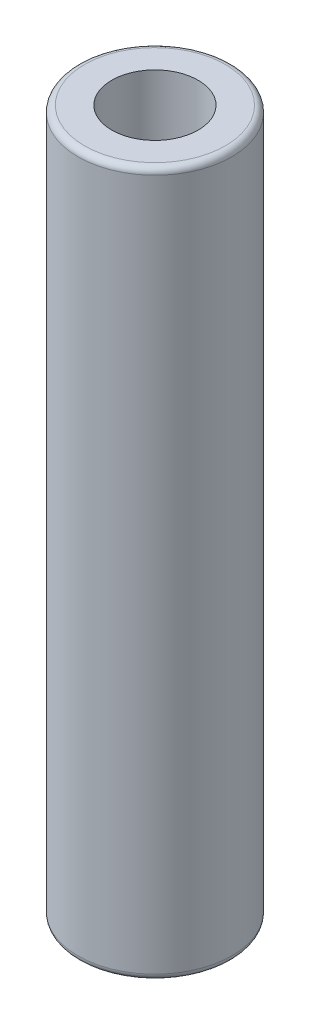
ISO-10303-21;
HEADER;
FILE_DESCRIPTION(('STEP AP214'),'2;1');
FILE_NAME('part.step','',(''),(''),'','','');
FILE_SCHEMA(('AUTOMOTIVE_DESIGN { 1 0 10303 214 1 1 1 1 }'));
ENDSEC;
DATA;
#1=APPLICATION_CONTEXT('core data for automotive mechanical design processes');
#2=APPLICATION_PROTOCOL_DEFINITION('international standard','automotive_design',2000,#1);
#3=PRODUCT_CONTEXT('',#1,'mechanical');
#4=PRODUCT('Part','Part','',(#3));
#5=PRODUCT_RELATED_PRODUCT_CATEGORY('part','',(#4));
#6=PRODUCT_DEFINITION_FORMATION('','',#4);
#7=PRODUCT_DEFINITION_CONTEXT('part definition',#1,'design');
#8=PRODUCT_DEFINITION('design','',#6,#7);
#9=PRODUCT_DEFINITION_SHAPE('','',#8);
#10=(LENGTH_UNIT() NAMED_UNIT(*) SI_UNIT(.MILLI.,.METRE.));
#11=(NAMED_UNIT(*) PLANE_ANGLE_UNIT() SI_UNIT($,.RADIAN.));
#12=(NAMED_UNIT(*) SI_UNIT($,.STERADIAN.) SOLID_ANGLE_UNIT());
#13=UNCERTAINTY_MEASURE_WITH_UNIT(LENGTH_MEASURE(1.E-05),#10,'distance_accuracy_value','');
#14=(GEOMETRIC_REPRESENTATION_CONTEXT(3) GLOBAL_UNCERTAINTY_ASSIGNED_CONTEXT((#13)) GLOBAL_UNIT_ASSIGNED_CONTEXT((#10,
#11,#12)) REPRESENTATION_CONTEXT('',''));
#15=CARTESIAN_POINT('',(0.,0.,0.));
#16=DIRECTION('',(0.,0.,1.));
#17=DIRECTION('',(1.,0.,0.));
#18=AXIS2_PLACEMENT_3D('',#15,#16,#17);
#19=CARTESIAN_POINT('',(8.73125000000003,0.,0.));
#20=DIRECTION('',(0.,1.,0.));
#21=DIRECTION('',(0.,0.,1.));
#22=AXIS2_PLACEMENT_3D('',#19,#20,#21);
#23=PLANE('',#22);
#24=CARTESIAN_POINT('',(0.,0.,0.));
#25=DIRECTION('',(0.,1.,0.));
#26=DIRECTION('',(0.,0.,1.));
#27=AXIS2_PLACEMENT_3D('',#24,#25,#26);
#28=CIRCLE('',#27,8.73125000000003);
#29=CARTESIAN_POINT('',(0.,0.,8.73125000000003));
#30=VERTEX_POINT('',#29);
#31=EDGE_CURVE('E11',#30,#30,#28,.T.);
#32=ORIENTED_EDGE('',*,*,#31,.F.);
#33=EDGE_LOOP('',(#32));
#34=FACE_BOUND('',#33,.T.);
#35=ADVANCED_FACE('F37',(#34),#23,.F.);
#36=CARTESIAN_POINT('',(0.,0.79375,0.));
#37=DIRECTION('',(0.,1.,0.));
#38=DIRECTION('',(0.,0.,1.));
#39=AXIS2_PLACEMENT_3D('',#36,#37,#38);
#40=TOROIDAL_SURFACE('',#39,8.73125000000004,0.79375);
#41=CARTESIAN_POINT('',(0.,0.793749999999982,0.));
#42=DIRECTION('',(0.,1.,0.));
#43=DIRECTION('',(0.,0.,1.));
#44=AXIS2_PLACEMENT_3D('',#41,#42,#43);
#45=CIRCLE('',#44,9.52500000000004);
#46=CARTESIAN_POINT('',(0.,0.793749999999982,9.52500000000004));
#47=VERTEX_POINT('',#46);
#48=EDGE_CURVE('E43',#47,#47,#45,.T.);
#49=ORIENTED_EDGE('',*,*,#48,.F.);
#50=EDGE_LOOP('',(#49));
#51=FACE_BOUND('',#50,.T.);
#52=ORIENTED_EDGE('',*,*,#31,.T.);
#53=EDGE_LOOP('',(#52));
#54=FACE_BOUND('',#53,.T.);
#55=ADVANCED_FACE('F71',(#51,#54),#40,.T.);
#56=CARTESIAN_POINT('',(0.,288.39215773182,0.));
#57=DIRECTION('',(0.,1.,0.));
#58=DIRECTION('',(0.,0.,1.));
#59=AXIS2_PLACEMENT_3D('',#56,#57,#58);
#60=CYLINDRICAL_SURFACE('',#59,9.52500000000003);
#61=CARTESIAN_POINT('',(0.,86.55685,0.));
#62=DIRECTION('',(0.,1.,0.));
#63=DIRECTION('',(0.,0.,1.));
#64=AXIS2_PLACEMENT_3D('',#61,#62,#63);
#65=CIRCLE('',#64,9.52500000000002);
#66=CARTESIAN_POINT('',(0.,86.55685,9.52500000000002));
#67=VERTEX_POINT('',#66);
#68=EDGE_CURVE('E60',#67,#67,#65,.T.);
#69=ORIENTED_EDGE('',*,*,#68,.F.);
#70=EDGE_LOOP('',(#69));
#71=FACE_BOUND('',#70,.T.);
#72=ORIENTED_EDGE('',*,*,#48,.T.);
#73=EDGE_LOOP('',(#72));
#74=FACE_BOUND('',#73,.T.);
#75=ADVANCED_FACE('F69',(#71,#74),#60,.T.);
#76=CARTESIAN_POINT('',(0.,86.55685,0.));
#77=DIRECTION('',(0.,1.,0.));
#78=DIRECTION('',(0.,0.,1.));
#79=AXIS2_PLACEMENT_3D('',#76,#77,#78);
#80=TOROIDAL_SURFACE('',#79,8.73125000000003,0.793749999999998);
#81=CARTESIAN_POINT('',(0.,87.3506,0.));
#82=DIRECTION('',(0.,1.,0.));
#83=DIRECTION('',(0.,0.,1.));
#84=AXIS2_PLACEMENT_3D('',#81,#82,#83);
#85=CIRCLE('',#84,8.73125000000002);
#86=CARTESIAN_POINT('',(0.,87.3506,8.73125000000002));
#87=VERTEX_POINT('',#86);
#88=EDGE_CURVE('E56',#87,#87,#85,.T.);
#89=ORIENTED_EDGE('',*,*,#88,.F.);
#90=EDGE_LOOP('',(#89));
#91=FACE_BOUND('',#90,.T.);
#92=ORIENTED_EDGE('',*,*,#68,.T.);
#93=EDGE_LOOP('',(#92));
#94=FACE_BOUND('',#93,.T.);
#95=ADVANCED_FACE('F89',(#91,#94),#80,.T.);
#96=CARTESIAN_POINT('',(0.,87.3506,0.));
#97=DIRECTION('',(0.,-1.,0.));
#98=DIRECTION('',(0.,0.,-1.));
#99=AXIS2_PLACEMENT_3D('',#96,#97,#98);
#100=PLANE('',#99);
#101=CARTESIAN_POINT('',(0.,87.3506,0.));
#102=DIRECTION('',(0.,1.,0.));
#103=DIRECTION('',(0.,0.,1.));
#104=AXIS2_PLACEMENT_3D('',#101,#102,#103);
#105=CIRCLE('',#104,5.35812999999999);
#106=CARTESIAN_POINT('',(0.,87.3506,5.35812999999999));
#107=VERTEX_POINT('',#106);
#108=EDGE_CURVE('E57',#107,#107,#105,.T.);
#109=ORIENTED_EDGE('',*,*,#108,.F.);
#110=EDGE_LOOP('',(#109));
#111=FACE_BOUND('',#110,.T.);
#112=ORIENTED_EDGE('',*,*,#88,.T.);
#113=EDGE_LOOP('',(#112));
#114=FACE_BOUND('',#113,.T.);
#115=ADVANCED_FACE('F50',(#111,#114),#100,.F.);
#116=CARTESIAN_POINT('',(0.,68.3006,0.));
#117=DIRECTION('',(0.,1.,0.));
#118=DIRECTION('',(0.,0.,1.));
#119=AXIS2_PLACEMENT_3D('',#116,#117,#118);
#120=CONICAL_SURFACE('',#119,5.35812999999999,1.02974425867665);
#121=CARTESIAN_POINT('',(0.,65.0811106913699,0.));
#122=VERTEX_POINT('',#121);
#123=VERTEX_LOOP('',#122);
#124=FACE_BOUND('',#123,.T.);
#125=CARTESIAN_POINT('',(0.,68.3006,0.));
#126=DIRECTION('',(0.,1.,0.));
#127=DIRECTION('',(0.,0.,1.));
#128=AXIS2_PLACEMENT_3D('',#125,#126,#127);
#129=CIRCLE('',#128,5.35812999999999);
#130=CARTESIAN_POINT('',(0.,68.3006,5.35812999999999));
#131=VERTEX_POINT('',#130);
#132=EDGE_CURVE('E54',#131,#131,#129,.T.);
#133=ORIENTED_EDGE('',*,*,#132,.T.);
#134=EDGE_LOOP('',(#133));
#135=FACE_BOUND('',#134,.T.);
#136=ADVANCED_FACE('F46',(#124,#135),#120,.F.);
#137=CARTESIAN_POINT('',(0.,87.3506,0.));
#138=DIRECTION('',(0.,1.,0.));
#139=DIRECTION('',(0.,0.,1.));
#140=AXIS2_PLACEMENT_3D('',#137,#138,#139);
#141=CYLINDRICAL_SURFACE('',#140,5.35812999999999);
#142=ORIENTED_EDGE('',*,*,#132,.F.);
#143=EDGE_LOOP('',(#142));
#144=FACE_BOUND('',#143,.T.);
#145=ORIENTED_EDGE('',*,*,#108,.T.);
#146=EDGE_LOOP('',(#145));
#147=FACE_BOUND('',#146,.T.);
#148=ADVANCED_FACE('F49',(#144,#147),#141,.F.);
#149=CLOSED_SHELL('',(#35,#55,#75,#95,#115,#136,#148));
#150=MANIFOLD_SOLID_BREP('B2',#149);
#151=ADVANCED_BREP_SHAPE_REPRESENTATION('',(#18,#150),#14);
#152=SHAPE_DEFINITION_REPRESENTATION(#9,#151);
ENDSEC;
END-ISO-10303-21;
